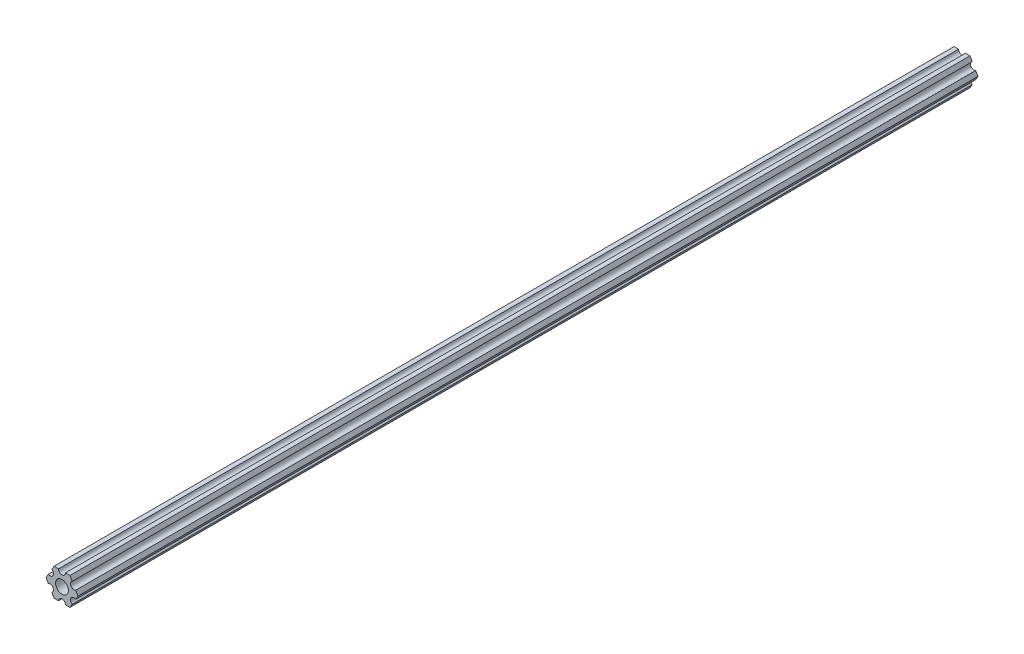
ISO-10303-21;
HEADER;
FILE_DESCRIPTION(('STEP AP214'),'2;1');
FILE_NAME('part.step','',(''),(''),'','','');
FILE_SCHEMA(('AUTOMOTIVE_DESIGN { 1 0 10303 214 1 1 1 1 }'));
ENDSEC;
DATA;
#1=APPLICATION_CONTEXT('core data for automotive mechanical design processes');
#2=APPLICATION_PROTOCOL_DEFINITION('international standard','automotive_design',2000,#1);
#3=PRODUCT_CONTEXT('',#1,'mechanical');
#4=PRODUCT('Part','Part','',(#3));
#5=PRODUCT_RELATED_PRODUCT_CATEGORY('part','',(#4));
#6=PRODUCT_DEFINITION_FORMATION('','',#4);
#7=PRODUCT_DEFINITION_CONTEXT('part definition',#1,'design');
#8=PRODUCT_DEFINITION('design','',#6,#7);
#9=PRODUCT_DEFINITION_SHAPE('','',#8);
#10=(LENGTH_UNIT() NAMED_UNIT(*) SI_UNIT(.MILLI.,.METRE.));
#11=(NAMED_UNIT(*) PLANE_ANGLE_UNIT() SI_UNIT($,.RADIAN.));
#12=(NAMED_UNIT(*) SI_UNIT($,.STERADIAN.) SOLID_ANGLE_UNIT());
#13=UNCERTAINTY_MEASURE_WITH_UNIT(LENGTH_MEASURE(1.E-05),#10,'distance_accuracy_value','');
#14=(GEOMETRIC_REPRESENTATION_CONTEXT(3) GLOBAL_UNCERTAINTY_ASSIGNED_CONTEXT((#13)) GLOBAL_UNIT_ASSIGNED_CONTEXT((#10,
#11,#12)) REPRESENTATION_CONTEXT('',''));
#15=CARTESIAN_POINT('',(0.,0.,0.));
#16=DIRECTION('',(0.,0.,1.));
#17=DIRECTION('',(1.,0.,0.));
#18=AXIS2_PLACEMENT_3D('',#15,#16,#17);
#19=CARTESIAN_POINT('',(6.29301142309098,-1.80018429024546,412.75));
#20=DIRECTION('',(-0.866025434075728,0.499999947533944,0.));
#21=DIRECTION('',(-0.499999947533944,-0.866025434075728,0.));
#22=AXIS2_PLACEMENT_3D('',#19,#20,#21);
#23=PLANE('',#22);
#24=DIRECTION('',(0.,0.,1.));
#25=VECTOR('',#24,1.);
#26=CARTESIAN_POINT('',(7.33234841870825,4.44212536187977E-07,412.75));
#27=LINE('',#26,#25);
#28=CARTESIAN_POINT('',(7.33234841870825,4.4421253590961E-07,0.));
#29=VERTEX_POINT('',#28);
#30=CARTESIAN_POINT('',(7.33234841870825,4.4421253664489E-07,412.75));
#31=VERTEX_POINT('',#30);
#32=EDGE_CURVE('E321',#29,#31,#27,.T.);
#33=ORIENTED_EDGE('',*,*,#32,.T.);
#34=DIRECTION('',(0.499999947533944,0.866025434075728,0.));
#35=VECTOR('',#34,1.);
#36=CARTESIAN_POINT('',(6.29301142309098,-1.80018429024546,412.75));
#37=LINE('',#36,#35);
#38=CARTESIAN_POINT('',(6.29301142309098,-1.80018429024546,412.75));
#39=VERTEX_POINT('',#38);
#40=EDGE_CURVE('E213',#39,#31,#37,.T.);
#41=ORIENTED_EDGE('',*,*,#40,.F.);
#42=DIRECTION('',(0.,0.,-1.));
#43=VECTOR('',#42,1.);
#44=CARTESIAN_POINT('',(6.29301142309098,-1.80018429024546,412.75));
#45=LINE('',#44,#43);
#46=CARTESIAN_POINT('',(6.29301142309098,-1.80018429024546,0.));
#47=VERTEX_POINT('',#46);
#48=EDGE_CURVE('E266',#39,#47,#45,.T.);
#49=ORIENTED_EDGE('',*,*,#48,.T.);
#50=DIRECTION('',(0.499999947533944,0.866025434075728,0.));
#51=VECTOR('',#50,1.);
#52=CARTESIAN_POINT('',(6.29301142309098,-1.80018429024546,0.));
#53=LINE('',#52,#51);
#54=EDGE_CURVE('E216',#47,#29,#53,.T.);
#55=ORIENTED_EDGE('',*,*,#54,.T.);
#56=EDGE_LOOP('',(#33,#41,#49,#55));
#57=FACE_BOUND('',#56,.T.);
#58=ADVANCED_FACE('F16',(#57),#23,.F.);
#59=CARTESIAN_POINT('',(7.33234841870825,4.44212536187977E-07,412.75));
#60=DIRECTION('',(-0.866025373493146,-0.500000052466055,0.));
#61=DIRECTION('',(0.500000052466055,-0.866025373493146,0.));
#62=AXIS2_PLACEMENT_3D('',#59,#60,#61);
#63=PLANE('',#62);
#64=DIRECTION('',(0.,0.,-1.));
#65=VECTOR('',#64,1.);
#66=CARTESIAN_POINT('',(6.29301120497139,1.80018505273895,412.75));
#67=LINE('',#66,#65);
#68=CARTESIAN_POINT('',(6.29301120497139,1.80018505273895,0.));
#69=VERTEX_POINT('',#68);
#70=CARTESIAN_POINT('',(6.29301120497139,1.80018505273895,412.75));
#71=VERTEX_POINT('',#70);
#72=EDGE_CURVE('E318',#69,#71,#67,.F.);
#73=ORIENTED_EDGE('',*,*,#72,.T.);
#74=DIRECTION('',(-0.500000052466055,0.866025373493145,0.));
#75=VECTOR('',#74,1.);
#76=CARTESIAN_POINT('',(7.33234841870825,4.44212536112459E-07,412.75));
#77=LINE('',#76,#75);
#78=EDGE_CURVE('E76',#31,#71,#77,.T.);
#79=ORIENTED_EDGE('',*,*,#78,.F.);
#80=ORIENTED_EDGE('',*,*,#32,.F.);
#81=DIRECTION('',(-0.500000052466055,0.866025373493145,0.));
#82=VECTOR('',#81,1.);
#83=CARTESIAN_POINT('',(7.33234841870825,4.44212536112459E-07,0.));
#84=LINE('',#83,#82);
#85=EDGE_CURVE('E262',#29,#69,#84,.T.);
#86=ORIENTED_EDGE('',*,*,#85,.T.);
#87=EDGE_LOOP('',(#73,#79,#80,#86));
#88=FACE_BOUND('',#87,.T.);
#89=ADVANCED_FACE('F380',(#88),#63,.F.);
#90=CARTESIAN_POINT('',(5.49926112168156,3.17500033315933,412.75));
#91=DIRECTION('',(0.,0.,-1.));
#92=DIRECTION('',(-1.,0.,0.));
#93=AXIS2_PLACEMENT_3D('',#90,#91,#92);
#94=CYLINDRICAL_SURFACE('',#93,1.5875);
#95=CARTESIAN_POINT('',(5.49926112168156,3.17500033315933,412.75));
#96=DIRECTION('',(0.,0.,-1.));
#97=DIRECTION('',(-1.,0.,0.));
#98=AXIS2_PLACEMENT_3D('',#95,#96,#97);
#99=CIRCLE('',#98,1.5875);
#100=CARTESIAN_POINT('',(4.70551103839172,4.54981561357972,412.75));
#101=VERTEX_POINT('',#100);
#102=EDGE_CURVE('E65',#71,#101,#99,.T.);
#103=ORIENTED_EDGE('',*,*,#102,.F.);
#104=ORIENTED_EDGE('',*,*,#72,.F.);
#105=CARTESIAN_POINT('',(5.49926112168156,3.17500033315933,0.));
#106=DIRECTION('',(0.,0.,-1.));
#107=DIRECTION('',(-1.,0.,0.));
#108=AXIS2_PLACEMENT_3D('',#105,#106,#107);
#109=CIRCLE('',#108,1.5875);
#110=CARTESIAN_POINT('',(4.70551103839172,4.54981561357972,0.));
#111=VERTEX_POINT('',#110);
#112=EDGE_CURVE('E19',#69,#111,#109,.T.);
#113=ORIENTED_EDGE('',*,*,#112,.T.);
#114=DIRECTION('',(0.,0.,1.));
#115=VECTOR('',#114,1.);
#116=CARTESIAN_POINT('',(4.70551103839172,4.54981561357972,412.75));
#117=LINE('',#116,#115);
#118=EDGE_CURVE('E315',#111,#101,#117,.T.);
#119=ORIENTED_EDGE('',*,*,#118,.T.);
#120=EDGE_LOOP('',(#103,#104,#113,#119));
#121=FACE_BOUND('',#120,.T.);
#122=ADVANCED_FACE('F378',(#121),#94,.F.);
#123=CARTESIAN_POINT('',(4.70551103839172,4.54981561357972,412.75));
#124=DIRECTION('',(-0.866025373493151,-0.500000052466046,0.));
#125=DIRECTION('',(0.500000052466046,-0.866025373493151,0.));
#126=AXIS2_PLACEMENT_3D('',#123,#124,#125);
#127=PLANE('',#126);
#128=DIRECTION('',(0.,0.,1.));
#129=VECTOR('',#128,1.);
#130=CARTESIAN_POINT('',(3.66617382465481,6.35000022210627,412.75));
#131=LINE('',#130,#129);
#132=CARTESIAN_POINT('',(3.66617382465481,6.35000022210627,-1.29526019539602E-13));
#133=VERTEX_POINT('',#132);
#134=CARTESIAN_POINT('',(3.66617382465481,6.35000022210627,412.75));
#135=VERTEX_POINT('',#134);
#136=EDGE_CURVE('E311',#133,#135,#131,.T.);
#137=ORIENTED_EDGE('',*,*,#136,.T.);
#138=DIRECTION('',(-0.500000052466046,0.866025373493151,0.));
#139=VECTOR('',#138,1.);
#140=CARTESIAN_POINT('',(4.70551103839172,4.54981561357972,412.75));
#141=LINE('',#140,#139);
#142=EDGE_CURVE('E208',#101,#135,#141,.T.);
#143=ORIENTED_EDGE('',*,*,#142,.F.);
#144=ORIENTED_EDGE('',*,*,#118,.F.);
#145=DIRECTION('',(-0.500000052466046,0.866025373493151,0.));
#146=VECTOR('',#145,1.);
#147=CARTESIAN_POINT('',(4.70551103839172,4.54981561357972,0.));
#148=LINE('',#147,#146);
#149=EDGE_CURVE('E258',#111,#133,#148,.T.);
#150=ORIENTED_EDGE('',*,*,#149,.T.);
#151=EDGE_LOOP('',(#137,#143,#144,#150));
#152=FACE_BOUND('',#151,.T.);
#153=ADVANCED_FACE('F369',(#152),#127,.F.);
#154=CARTESIAN_POINT('',(3.66617382465481,6.35000022210627,412.75));
#155=DIRECTION('',(6.05825850611185E-08,-0.999999999999998,0.));
#156=DIRECTION('',(0.999999999999998,6.05825850611185E-08,0.));
#157=AXIS2_PLACEMENT_3D('',#154,#155,#156);
#158=PLANE('',#157);
#159=DIRECTION('',(0.,0.,-1.));
#160=VECTOR('',#159,1.);
#161=CARTESIAN_POINT('',(1.58749961530074,6.35000009617482,412.75));
#162=LINE('',#161,#160);
#163=CARTESIAN_POINT('',(1.58749961530073,6.35000015914054,0.));
#164=VERTEX_POINT('',#163);
#165=CARTESIAN_POINT('',(1.58749961530073,6.35000015914054,412.75));
#166=VERTEX_POINT('',#165);
#167=EDGE_CURVE('E308',#164,#166,#162,.F.);
#168=ORIENTED_EDGE('',*,*,#167,.T.);
#169=DIRECTION('',(1.,0.,0.));
#170=VECTOR('',#169,1.);
#171=CARTESIAN_POINT('',(5.49926112168156,6.35000022210627,412.75));
#172=LINE('',#171,#170);
#173=EDGE_CURVE('E175',#135,#166,#172,.F.);
#174=ORIENTED_EDGE('',*,*,#173,.F.);
#175=ORIENTED_EDGE('',*,*,#136,.F.);
#176=DIRECTION('',(1.,0.,0.));
#177=VECTOR('',#176,1.);
#178=CARTESIAN_POINT('',(5.49926112168156,6.35000022210627,0.));
#179=LINE('',#178,#177);
#180=EDGE_CURVE('E254',#133,#164,#179,.F.);
#181=ORIENTED_EDGE('',*,*,#180,.T.);
#182=EDGE_LOOP('',(#168,#174,#175,#181));
#183=FACE_BOUND('',#182,.T.);
#184=ADVANCED_FACE('F366',(#183),#158,.F.);
#185=CARTESIAN_POINT('',(-3.84699260060323E-07,6.35,412.75));
#186=DIRECTION('',(0.,0.,-1.));
#187=DIRECTION('',(-1.,0.,0.));
#188=AXIS2_PLACEMENT_3D('',#185,#186,#187);
#189=CYLINDRICAL_SURFACE('',#188,1.5875);
#190=DIRECTION('',(0.,0.,1.));
#191=VECTOR('',#190,1.);
#192=CARTESIAN_POINT('',(-1.58750038469926,6.34999990382518,412.75));
#193=LINE('',#192,#191);
#194=CARTESIAN_POINT('',(-1.58750038469926,6.34999990382518,0.));
#195=VERTEX_POINT('',#194);
#196=CARTESIAN_POINT('',(-1.58750038469926,6.34999990382518,412.75));
#197=VERTEX_POINT('',#196);
#198=EDGE_CURVE('E126',#195,#197,#193,.T.);
#199=ORIENTED_EDGE('',*,*,#198,.T.);
#200=CARTESIAN_POINT('',(-3.84699260060323E-07,6.35,412.75));
#201=DIRECTION('',(0.,0.,-1.));
#202=DIRECTION('',(-1.,0.,0.));
#203=AXIS2_PLACEMENT_3D('',#200,#201,#202);
#204=CIRCLE('',#203,1.5875);
#205=EDGE_CURVE('E181',#166,#197,#204,.T.);
#206=ORIENTED_EDGE('',*,*,#205,.F.);
#207=ORIENTED_EDGE('',*,*,#167,.F.);
#208=CARTESIAN_POINT('',(-3.84699260060323E-07,6.35,0.));
#209=DIRECTION('',(0.,0.,-1.));
#210=DIRECTION('',(-1.,0.,0.));
#211=AXIS2_PLACEMENT_3D('',#208,#209,#210);
#212=CIRCLE('',#211,1.5875);
#213=EDGE_CURVE('E253',#164,#195,#212,.T.);
#214=ORIENTED_EDGE('',*,*,#213,.T.);
#215=EDGE_LOOP('',(#199,#206,#207,#214));
#216=FACE_BOUND('',#215,.T.);
#217=ADVANCED_FACE('F360',(#216),#189,.F.);
#218=CARTESIAN_POINT('',(-1.58750038469926,6.34999990382518,412.75));
#219=DIRECTION('',(6.05825963273174E-08,-0.999999999999998,0.));
#220=DIRECTION('',(0.999999999999998,6.05825963273174E-08,0.));
#221=AXIS2_PLACEMENT_3D('',#218,#219,#220);
#222=PLANE('',#221);
#223=DIRECTION('',(0.,0.,1.));
#224=VECTOR('',#223,1.);
#225=CARTESIAN_POINT('',(-3.66617459405349,6.3499997778937,412.75));
#226=LINE('',#225,#224);
#227=CARTESIAN_POINT('',(-3.66617454558244,6.34999986184803,-1.29526019539602E-13));
#228=VERTEX_POINT('',#227);
#229=CARTESIAN_POINT('',(-3.66617454558244,6.34999986184803,412.75));
#230=VERTEX_POINT('',#229);
#231=EDGE_CURVE('E136',#228,#230,#226,.T.);
#232=ORIENTED_EDGE('',*,*,#231,.T.);
#233=DIRECTION('',(1.,0.,0.));
#234=VECTOR('',#233,1.);
#235=CARTESIAN_POINT('',(5.49926112168156,6.34999990382518,412.75));
#236=LINE('',#235,#234);
#237=EDGE_CURVE('E182',#197,#230,#236,.F.);
#238=ORIENTED_EDGE('',*,*,#237,.F.);
#239=ORIENTED_EDGE('',*,*,#198,.F.);
#240=DIRECTION('',(1.,0.,0.));
#241=VECTOR('',#240,1.);
#242=CARTESIAN_POINT('',(5.49926112168156,6.34999990382518,0.));
#243=LINE('',#242,#241);
#244=EDGE_CURVE('E190',#195,#228,#243,.F.);
#245=ORIENTED_EDGE('',*,*,#244,.T.);
#246=EDGE_LOOP('',(#232,#238,#239,#245));
#247=FACE_BOUND('',#246,.T.);
#248=ADVANCED_FACE('F189',(#247),#222,.F.);
#249=CARTESIAN_POINT('',(-3.66617459405349,6.3499997778937,412.75));
#250=DIRECTION('',(0.866025434075729,-0.499999947533942,0.));
#251=DIRECTION('',(0.499999947533942,0.866025434075729,0.));
#252=AXIS2_PLACEMENT_3D('',#249,#250,#251);
#253=PLANE('',#252);
#254=DIRECTION('',(0.,0.,-1.));
#255=VECTOR('',#254,1.);
#256=CARTESIAN_POINT('',(-4.70551158967065,4.54981504343587,412.75));
#257=LINE('',#256,#255);
#258=CARTESIAN_POINT('',(-4.70551158967065,4.54981504343587,0.));
#259=VERTEX_POINT('',#258);
#260=CARTESIAN_POINT('',(-4.70551158967065,4.54981504343587,412.75));
#261=VERTEX_POINT('',#260);
#262=EDGE_CURVE('E192',#259,#261,#257,.F.);
#263=ORIENTED_EDGE('',*,*,#262,.T.);
#264=DIRECTION('',(-0.499999947533943,-0.866025434075729,0.));
#265=VECTOR('',#264,1.);
#266=CARTESIAN_POINT('',(-3.66617459405349,6.3499997778937,412.75));
#267=LINE('',#266,#265);
#268=EDGE_CURVE('E185',#230,#261,#267,.T.);
#269=ORIENTED_EDGE('',*,*,#268,.F.);
#270=ORIENTED_EDGE('',*,*,#231,.F.);
#271=DIRECTION('',(-0.499999947533943,-0.866025434075729,0.));
#272=VECTOR('',#271,1.);
#273=CARTESIAN_POINT('',(-3.66617459405349,6.3499997778937,0.));
#274=LINE('',#273,#272);
#275=EDGE_CURVE('E248',#228,#259,#274,.T.);
#276=ORIENTED_EDGE('',*,*,#275,.T.);
#277=EDGE_LOOP('',(#263,#269,#270,#276));
#278=FACE_BOUND('',#277,.T.);
#279=ADVANCED_FACE('F194',(#278),#253,.F.);
#280=CARTESIAN_POINT('',(-5.49926150638082,3.17499966684067,412.75));
#281=DIRECTION('',(0.,0.,-1.));
#282=DIRECTION('',(-1.,0.,0.));
#283=AXIS2_PLACEMENT_3D('',#280,#281,#282);
#284=CYLINDRICAL_SURFACE('',#283,1.5875);
#285=DIRECTION('',(0.,0.,1.));
#286=VECTOR('',#285,1.);
#287=CARTESIAN_POINT('',(-6.29301142309098,1.80018429024547,412.75));
#288=LINE('',#287,#286);
#289=CARTESIAN_POINT('',(-6.29301142309098,1.80018429024547,0.));
#290=VERTEX_POINT('',#289);
#291=CARTESIAN_POINT('',(-6.29301142309098,1.80018429024547,412.75));
#292=VERTEX_POINT('',#291);
#293=EDGE_CURVE('E300',#290,#292,#288,.T.);
#294=ORIENTED_EDGE('',*,*,#293,.T.);
#295=CARTESIAN_POINT('',(-5.49926150638082,3.17499966684067,412.75));
#296=DIRECTION('',(0.,0.,-1.));
#297=DIRECTION('',(-1.,0.,0.));
#298=AXIS2_PLACEMENT_3D('',#295,#296,#297);
#299=CIRCLE('',#298,1.5875);
#300=EDGE_CURVE('E197',#261,#292,#299,.T.);
#301=ORIENTED_EDGE('',*,*,#300,.F.);
#302=ORIENTED_EDGE('',*,*,#262,.F.);
#303=CARTESIAN_POINT('',(-5.49926150638082,3.17499966684067,0.));
#304=DIRECTION('',(0.,0.,-1.));
#305=DIRECTION('',(-1.,0.,0.));
#306=AXIS2_PLACEMENT_3D('',#303,#304,#305);
#307=CIRCLE('',#306,1.5875);
#308=EDGE_CURVE('E247',#259,#290,#307,.T.);
#309=ORIENTED_EDGE('',*,*,#308,.T.);
#310=EDGE_LOOP('',(#294,#301,#302,#309));
#311=FACE_BOUND('',#310,.T.);
#312=ADVANCED_FACE('F443',(#311),#284,.F.);
#313=CARTESIAN_POINT('',(-6.29301142309098,1.80018429024547,412.75));
#314=DIRECTION('',(0.866025434075724,-0.499999947533951,0.));
#315=DIRECTION('',(0.499999947533951,0.866025434075724,0.));
#316=AXIS2_PLACEMENT_3D('',#313,#314,#315);
#317=PLANE('',#316);
#318=DIRECTION('',(0.,0.,1.));
#319=VECTOR('',#318,1.);
#320=CARTESIAN_POINT('',(-7.33234841870826,-4.44212523790841E-07,412.75));
#321=LINE('',#320,#319);
#322=CARTESIAN_POINT('',(-7.33234841870826,-4.44212524036367E-07,0.));
#323=VERTEX_POINT('',#322);
#324=CARTESIAN_POINT('',(-7.33234841870826,-4.44212524036367E-07,412.75));
#325=VERTEX_POINT('',#324);
#326=EDGE_CURVE('E296',#323,#325,#321,.T.);
#327=ORIENTED_EDGE('',*,*,#326,.T.);
#328=DIRECTION('',(-0.499999947533952,-0.866025434075724,0.));
#329=VECTOR('',#328,1.);
#330=CARTESIAN_POINT('',(-6.29301142309098,1.80018429024547,412.75));
#331=LINE('',#330,#329);
#332=EDGE_CURVE('E202',#292,#325,#331,.T.);
#333=ORIENTED_EDGE('',*,*,#332,.F.);
#334=ORIENTED_EDGE('',*,*,#293,.F.);
#335=DIRECTION('',(-0.499999947533952,-0.866025434075724,0.));
#336=VECTOR('',#335,1.);
#337=CARTESIAN_POINT('',(-6.29301142309098,1.80018429024547,0.));
#338=LINE('',#337,#336);
#339=EDGE_CURVE('E243',#290,#323,#338,.T.);
#340=ORIENTED_EDGE('',*,*,#339,.T.);
#341=EDGE_LOOP('',(#327,#333,#334,#340));
#342=FACE_BOUND('',#341,.T.);
#343=ADVANCED_FACE('F406',(#342),#317,.F.);
#344=CARTESIAN_POINT('',(-7.33234841870826,-4.44212523790841E-07,412.75));
#345=DIRECTION('',(0.866025373493151,0.500000052466045,0.));
#346=DIRECTION('',(-0.500000052466045,0.866025373493151,0.));
#347=AXIS2_PLACEMENT_3D('',#344,#345,#346);
#348=PLANE('',#347);
#349=DIRECTION('',(0.,0.,-1.));
#350=VECTOR('',#349,1.);
#351=CARTESIAN_POINT('',(-6.29301120497141,-1.80018505273896,412.75));
#352=LINE('',#351,#350);
#353=CARTESIAN_POINT('',(-6.29301120497141,-1.80018505273896,0.));
#354=VERTEX_POINT('',#353);
#355=CARTESIAN_POINT('',(-6.29301120497141,-1.80018505273896,412.75));
#356=VERTEX_POINT('',#355);
#357=EDGE_CURVE('E292',#354,#356,#352,.F.);
#358=ORIENTED_EDGE('',*,*,#357,.T.);
#359=DIRECTION('',(0.500000052466045,-0.866025373493151,0.));
#360=VECTOR('',#359,1.);
#361=CARTESIAN_POINT('',(-7.33234841870826,-4.44212523969395E-07,412.75));
#362=LINE('',#361,#360);
#363=EDGE_CURVE('E339',#325,#356,#362,.T.);
#364=ORIENTED_EDGE('',*,*,#363,.F.);
#365=ORIENTED_EDGE('',*,*,#326,.F.);
#366=DIRECTION('',(0.500000052466045,-0.866025373493151,0.));
#367=VECTOR('',#366,1.);
#368=CARTESIAN_POINT('',(-7.33234841870826,-4.44212523969395E-07,0.));
#369=LINE('',#368,#367);
#370=EDGE_CURVE('E239',#323,#354,#369,.T.);
#371=ORIENTED_EDGE('',*,*,#370,.T.);
#372=EDGE_LOOP('',(#358,#364,#365,#371));
#373=FACE_BOUND('',#372,.T.);
#374=ADVANCED_FACE('F410',(#373),#348,.F.);
#375=CARTESIAN_POINT('',(-5.49926112168156,-3.17500033315934,412.75));
#376=DIRECTION('',(0.,0.,-1.));
#377=DIRECTION('',(-1.,0.,0.));
#378=AXIS2_PLACEMENT_3D('',#375,#376,#377);
#379=CYLINDRICAL_SURFACE('',#378,1.5875);
#380=DIRECTION('',(0.,0.,1.));
#381=VECTOR('',#380,1.);
#382=CARTESIAN_POINT('',(-4.70551103839172,-4.54981561357972,412.75));
#383=LINE('',#382,#381);
#384=CARTESIAN_POINT('',(-4.70551103839172,-4.54981561357972,0.));
#385=VERTEX_POINT('',#384);
#386=CARTESIAN_POINT('',(-4.70551103839172,-4.54981561357972,412.75));
#387=VERTEX_POINT('',#386);
#388=EDGE_CURVE('E288',#385,#387,#383,.T.);
#389=ORIENTED_EDGE('',*,*,#388,.T.);
#390=CARTESIAN_POINT('',(-5.49926112168156,-3.17500033315934,412.75));
#391=DIRECTION('',(0.,0.,-1.));
#392=DIRECTION('',(-1.,0.,0.));
#393=AXIS2_PLACEMENT_3D('',#390,#391,#392);
#394=CIRCLE('',#393,1.5875);
#395=EDGE_CURVE('E336',#356,#387,#394,.T.);
#396=ORIENTED_EDGE('',*,*,#395,.F.);
#397=ORIENTED_EDGE('',*,*,#357,.F.);
#398=CARTESIAN_POINT('',(-5.49926112168156,-3.17500033315934,0.));
#399=DIRECTION('',(0.,0.,-1.));
#400=DIRECTION('',(-1.,0.,0.));
#401=AXIS2_PLACEMENT_3D('',#398,#399,#400);
#402=CIRCLE('',#401,1.5875);
#403=EDGE_CURVE('E238',#354,#385,#402,.T.);
#404=ORIENTED_EDGE('',*,*,#403,.T.);
#405=EDGE_LOOP('',(#389,#396,#397,#404));
#406=FACE_BOUND('',#405,.T.);
#407=ADVANCED_FACE('F414',(#406),#379,.F.);
#408=CARTESIAN_POINT('',(-4.70551103839172,-4.54981561357972,412.75));
#409=DIRECTION('',(0.866025373493151,0.500000052466045,0.));
#410=DIRECTION('',(-0.500000052466045,0.866025373493151,0.));
#411=AXIS2_PLACEMENT_3D('',#408,#409,#410);
#412=PLANE('',#411);
#413=DIRECTION('',(0.,0.,1.));
#414=VECTOR('',#413,1.);
#415=CARTESIAN_POINT('',(-3.66617382465481,-6.35000022210628,412.75));
#416=LINE('',#415,#414);
#417=CARTESIAN_POINT('',(-3.6661738246548,-6.35000022210628,-1.29526019539602E-13));
#418=VERTEX_POINT('',#417);
#419=CARTESIAN_POINT('',(-3.6661738246548,-6.35000022210628,412.75));
#420=VERTEX_POINT('',#419);
#421=EDGE_CURVE('E284',#418,#420,#416,.T.);
#422=ORIENTED_EDGE('',*,*,#421,.T.);
#423=DIRECTION('',(0.500000052466045,-0.866025373493151,0.));
#424=VECTOR('',#423,1.);
#425=CARTESIAN_POINT('',(-4.70551103839172,-4.54981561357972,412.75));
#426=LINE('',#425,#424);
#427=EDGE_CURVE('E338',#387,#420,#426,.T.);
#428=ORIENTED_EDGE('',*,*,#427,.F.);
#429=ORIENTED_EDGE('',*,*,#388,.F.);
#430=DIRECTION('',(0.500000052466045,-0.866025373493151,0.));
#431=VECTOR('',#430,1.);
#432=CARTESIAN_POINT('',(-4.70551103839172,-4.54981561357972,0.));
#433=LINE('',#432,#431);
#434=EDGE_CURVE('E234',#385,#418,#433,.T.);
#435=ORIENTED_EDGE('',*,*,#434,.T.);
#436=EDGE_LOOP('',(#422,#428,#429,#435));
#437=FACE_BOUND('',#436,.T.);
#438=ADVANCED_FACE('F421',(#437),#412,.F.);
#439=CARTESIAN_POINT('',(-3.66617382465481,-6.35000022210628,412.75));
#440=DIRECTION('',(-6.05825854783851E-08,0.999999999999998,0.));
#441=DIRECTION('',(-0.999999999999998,-6.05825854783851E-08,0.));
#442=AXIS2_PLACEMENT_3D('',#439,#440,#441);
#443=PLANE('',#442);
#444=DIRECTION('',(0.,0.,-1.));
#445=VECTOR('',#444,1.);
#446=CARTESIAN_POINT('',(-1.58749961530074,-6.35,412.75));
#447=LINE('',#446,#445);
#448=CARTESIAN_POINT('',(-1.58749961530073,-6.35000011105314,0.));
#449=VERTEX_POINT('',#448);
#450=CARTESIAN_POINT('',(-1.58749961530073,-6.35000011105314,412.75));
#451=VERTEX_POINT('',#450);
#452=EDGE_CURVE('E280',#449,#451,#447,.F.);
#453=ORIENTED_EDGE('',*,*,#452,.T.);
#454=DIRECTION('',(1.,0.,0.));
#455=VECTOR('',#454,1.);
#456=CARTESIAN_POINT('',(5.49926112168156,-6.35000022210628,412.75));
#457=LINE('',#456,#455);
#458=EDGE_CURVE('E335',#420,#451,#457,.T.);
#459=ORIENTED_EDGE('',*,*,#458,.F.);
#460=ORIENTED_EDGE('',*,*,#421,.F.);
#461=DIRECTION('',(1.,0.,0.));
#462=VECTOR('',#461,1.);
#463=CARTESIAN_POINT('',(5.49926112168156,-6.35000022210628,0.));
#464=LINE('',#463,#462);
#465=EDGE_CURVE('E230',#418,#449,#464,.T.);
#466=ORIENTED_EDGE('',*,*,#465,.T.);
#467=EDGE_LOOP('',(#453,#459,#460,#466));
#468=FACE_BOUND('',#467,.T.);
#469=ADVANCED_FACE('F425',(#468),#443,.F.);
#470=CARTESIAN_POINT('',(3.8469926204343E-07,-6.35,412.75));
#471=DIRECTION('',(0.,0.,-1.));
#472=DIRECTION('',(-1.,0.,0.));
#473=AXIS2_PLACEMENT_3D('',#470,#471,#472);
#474=CYLINDRICAL_SURFACE('',#473,1.5875);
#475=DIRECTION('',(0.,0.,1.));
#476=VECTOR('',#475,1.);
#477=CARTESIAN_POINT('',(1.58750038469926,-6.34999990382518,412.75));
#478=LINE('',#477,#476);
#479=CARTESIAN_POINT('',(1.58750038469926,-6.34999990382518,0.));
#480=VERTEX_POINT('',#479);
#481=CARTESIAN_POINT('',(1.58750038469926,-6.34999990382518,412.75));
#482=VERTEX_POINT('',#481);
#483=EDGE_CURVE('E276',#480,#482,#478,.T.);
#484=ORIENTED_EDGE('',*,*,#483,.T.);
#485=CARTESIAN_POINT('',(3.8469926204343E-07,-6.35,412.75));
#486=DIRECTION('',(0.,0.,-1.));
#487=DIRECTION('',(-1.,0.,0.));
#488=AXIS2_PLACEMENT_3D('',#485,#486,#487);
#489=CIRCLE('',#488,1.5875);
#490=EDGE_CURVE('E331',#451,#482,#489,.T.);
#491=ORIENTED_EDGE('',*,*,#490,.F.);
#492=ORIENTED_EDGE('',*,*,#452,.F.);
#493=CARTESIAN_POINT('',(3.8469926204343E-07,-6.35,0.));
#494=DIRECTION('',(0.,0.,-1.));
#495=DIRECTION('',(-1.,0.,0.));
#496=AXIS2_PLACEMENT_3D('',#493,#494,#495);
#497=CIRCLE('',#496,1.5875);
#498=EDGE_CURVE('E229',#449,#480,#497,.T.);
#499=ORIENTED_EDGE('',*,*,#498,.T.);
#500=EDGE_LOOP('',(#484,#491,#492,#499));
#501=FACE_BOUND('',#500,.T.);
#502=ADVANCED_FACE('F429',(#501),#474,.F.);
#503=CARTESIAN_POINT('',(1.58750038469926,-6.34999990382518,412.75));
#504=DIRECTION('',(-6.05825721258438E-08,0.999999999999998,0.));
#505=DIRECTION('',(-0.999999999999998,-6.05825721258438E-08,0.));
#506=AXIS2_PLACEMENT_3D('',#503,#504,#505);
#507=PLANE('',#506);
#508=DIRECTION('',(0.,0.,1.));
#509=VECTOR('',#508,1.);
#510=CARTESIAN_POINT('',(3.66617459405346,-6.34999977789375,412.75));
#511=LINE('',#510,#509);
#512=CARTESIAN_POINT('',(3.66617454558244,-6.34999986184804,-1.29526019539602E-13));
#513=VERTEX_POINT('',#512);
#514=CARTESIAN_POINT('',(3.66617454558244,-6.34999986184804,412.75));
#515=VERTEX_POINT('',#514);
#516=EDGE_CURVE('E272',#513,#515,#511,.T.);
#517=ORIENTED_EDGE('',*,*,#516,.T.);
#518=DIRECTION('',(1.,0.,0.));
#519=VECTOR('',#518,1.);
#520=CARTESIAN_POINT('',(5.49926112168156,-6.34999990382518,412.75));
#521=LINE('',#520,#519);
#522=EDGE_CURVE('E334',#482,#515,#521,.T.);
#523=ORIENTED_EDGE('',*,*,#522,.F.);
#524=ORIENTED_EDGE('',*,*,#483,.F.);
#525=DIRECTION('',(1.,0.,0.));
#526=VECTOR('',#525,1.);
#527=CARTESIAN_POINT('',(5.49926112168156,-6.34999990382518,0.));
#528=LINE('',#527,#526);
#529=EDGE_CURVE('E225',#480,#513,#528,.T.);
#530=ORIENTED_EDGE('',*,*,#529,.T.);
#531=EDGE_LOOP('',(#517,#523,#524,#530));
#532=FACE_BOUND('',#531,.T.);
#533=ADVANCED_FACE('F432',(#532),#507,.F.);
#534=CARTESIAN_POINT('',(3.66617459405346,-6.34999977789375,412.75));
#535=DIRECTION('',(-0.86602543407573,0.499999947533941,0.));
#536=DIRECTION('',(-0.499999947533941,-0.86602543407573,0.));
#537=AXIS2_PLACEMENT_3D('',#534,#535,#536);
#538=PLANE('',#537);
#539=DIRECTION('',(0.,0.,1.));
#540=VECTOR('',#539,1.);
#541=CARTESIAN_POINT('',(4.70551158967065,-4.54981504343587,412.75));
#542=LINE('',#541,#540);
#543=CARTESIAN_POINT('',(4.70551158967065,-4.54981504343587,412.75));
#544=VERTEX_POINT('',#543);
#545=CARTESIAN_POINT('',(4.70551158967065,-4.54981504343587,0.));
#546=VERTEX_POINT('',#545);
#547=EDGE_CURVE('E269',#544,#546,#542,.F.);
#548=ORIENTED_EDGE('',*,*,#547,.F.);
#549=DIRECTION('',(0.49999994753394,0.86602543407573,0.));
#550=VECTOR('',#549,1.);
#551=CARTESIAN_POINT('',(3.66617459405346,-6.34999977789376,412.75));
#552=LINE('',#551,#550);
#553=EDGE_CURVE('E330',#515,#544,#552,.T.);
#554=ORIENTED_EDGE('',*,*,#553,.F.);
#555=ORIENTED_EDGE('',*,*,#516,.F.);
#556=DIRECTION('',(0.49999994753394,0.86602543407573,0.));
#557=VECTOR('',#556,1.);
#558=CARTESIAN_POINT('',(3.66617459405346,-6.34999977789376,0.));
#559=LINE('',#558,#557);
#560=EDGE_CURVE('E221',#513,#546,#559,.T.);
#561=ORIENTED_EDGE('',*,*,#560,.T.);
#562=EDGE_LOOP('',(#548,#554,#555,#561));
#563=FACE_BOUND('',#562,.T.);
#564=ADVANCED_FACE('F434',(#563),#538,.F.);
#565=CARTESIAN_POINT('',(5.49926150638082,-3.17499966684067,412.75));
#566=DIRECTION('',(0.,0.,-1.));
#567=DIRECTION('',(-1.,0.,0.));
#568=AXIS2_PLACEMENT_3D('',#565,#566,#567);
#569=CYLINDRICAL_SURFACE('',#568,1.58750000000001);
#570=CARTESIAN_POINT('',(5.49926150638082,-3.17499966684067,412.75));
#571=DIRECTION('',(0.,0.,-1.));
#572=DIRECTION('',(-1.,0.,0.));
#573=AXIS2_PLACEMENT_3D('',#570,#571,#572);
#574=CIRCLE('',#573,1.58750000000001);
#575=EDGE_CURVE('E39',#544,#39,#574,.T.);
#576=ORIENTED_EDGE('',*,*,#575,.F.);
#577=ORIENTED_EDGE('',*,*,#547,.T.);
#578=CARTESIAN_POINT('',(5.49926150638082,-3.17499966684067,0.));
#579=DIRECTION('',(0.,0.,-1.));
#580=DIRECTION('',(-1.,0.,0.));
#581=AXIS2_PLACEMENT_3D('',#578,#579,#580);
#582=CIRCLE('',#581,1.58750000000001);
#583=EDGE_CURVE('E220',#546,#47,#582,.T.);
#584=ORIENTED_EDGE('',*,*,#583,.T.);
#585=ORIENTED_EDGE('',*,*,#48,.F.);
#586=EDGE_LOOP('',(#576,#577,#584,#585));
#587=FACE_BOUND('',#586,.T.);
#588=ADVANCED_FACE('F384',(#587),#569,.F.);
#589=CARTESIAN_POINT('',(5.49926112168156,3.17500033315933,0.));
#590=DIRECTION('',(0.,0.,1.));
#591=DIRECTION('',(1.,0.,0.));
#592=AXIS2_PLACEMENT_3D('',#589,#590,#591);
#593=PLANE('',#592);
#594=CARTESIAN_POINT('',(0.,0.,0.));
#595=DIRECTION('',(0.,0.,-1.));
#596=DIRECTION('',(-1.,0.,0.));
#597=AXIS2_PLACEMENT_3D('',#594,#595,#596);
#598=CIRCLE('',#597,2.9337);
#599=CARTESIAN_POINT('',(-2.9337,0.,0.));
#600=VERTEX_POINT('',#599);
#601=EDGE_CURVE('E26',#600,#600,#598,.F.);
#602=ORIENTED_EDGE('',*,*,#601,.T.);
#603=EDGE_LOOP('',(#602));
#604=FACE_BOUND('',#603,.T.);
#605=ORIENTED_EDGE('',*,*,#583,.F.);
#606=ORIENTED_EDGE('',*,*,#560,.F.);
#607=ORIENTED_EDGE('',*,*,#529,.F.);
#608=ORIENTED_EDGE('',*,*,#498,.F.);
#609=ORIENTED_EDGE('',*,*,#465,.F.);
#610=ORIENTED_EDGE('',*,*,#434,.F.);
#611=ORIENTED_EDGE('',*,*,#403,.F.);
#612=ORIENTED_EDGE('',*,*,#370,.F.);
#613=ORIENTED_EDGE('',*,*,#339,.F.);
#614=ORIENTED_EDGE('',*,*,#308,.F.);
#615=ORIENTED_EDGE('',*,*,#275,.F.);
#616=ORIENTED_EDGE('',*,*,#244,.F.);
#617=ORIENTED_EDGE('',*,*,#213,.F.);
#618=ORIENTED_EDGE('',*,*,#180,.F.);
#619=ORIENTED_EDGE('',*,*,#149,.F.);
#620=ORIENTED_EDGE('',*,*,#112,.F.);
#621=ORIENTED_EDGE('',*,*,#85,.F.);
#622=ORIENTED_EDGE('',*,*,#54,.F.);
#623=EDGE_LOOP('',(#605,#606,#607,#608,#609,#610,#611,#612,#613,#614,#615,#616,#617,#618,#619,
#620,#621,#622));
#624=FACE_BOUND('',#623,.T.);
#625=ADVANCED_FACE('F363',(#604,#624),#593,.F.);
#626=CARTESIAN_POINT('',(5.49926112168156,3.17500033315933,412.75));
#627=DIRECTION('',(0.,0.,1.));
#628=DIRECTION('',(1.,0.,0.));
#629=AXIS2_PLACEMENT_3D('',#626,#627,#628);
#630=PLANE('',#629);
#631=CARTESIAN_POINT('',(0.,0.,412.75));
#632=DIRECTION('',(0.,0.,-1.));
#633=DIRECTION('',(-1.,0.,0.));
#634=AXIS2_PLACEMENT_3D('',#631,#632,#633);
#635=CIRCLE('',#634,2.9337);
#636=CARTESIAN_POINT('',(-2.9337,0.,412.75));
#637=VERTEX_POINT('',#636);
#638=EDGE_CURVE('E11',#637,#637,#635,.T.);
#639=ORIENTED_EDGE('',*,*,#638,.T.);
#640=EDGE_LOOP('',(#639));
#641=FACE_BOUND('',#640,.T.);
#642=ORIENTED_EDGE('',*,*,#553,.T.);
#643=ORIENTED_EDGE('',*,*,#575,.T.);
#644=ORIENTED_EDGE('',*,*,#40,.T.);
#645=ORIENTED_EDGE('',*,*,#78,.T.);
#646=ORIENTED_EDGE('',*,*,#102,.T.);
#647=ORIENTED_EDGE('',*,*,#142,.T.);
#648=ORIENTED_EDGE('',*,*,#173,.T.);
#649=ORIENTED_EDGE('',*,*,#205,.T.);
#650=ORIENTED_EDGE('',*,*,#237,.T.);
#651=ORIENTED_EDGE('',*,*,#268,.T.);
#652=ORIENTED_EDGE('',*,*,#300,.T.);
#653=ORIENTED_EDGE('',*,*,#332,.T.);
#654=ORIENTED_EDGE('',*,*,#363,.T.);
#655=ORIENTED_EDGE('',*,*,#395,.T.);
#656=ORIENTED_EDGE('',*,*,#427,.T.);
#657=ORIENTED_EDGE('',*,*,#458,.T.);
#658=ORIENTED_EDGE('',*,*,#490,.T.);
#659=ORIENTED_EDGE('',*,*,#522,.T.);
#660=EDGE_LOOP('',(#642,#643,#644,#645,#646,#647,#648,#649,#650,#651,#652,#653,#654,#655,#656,
#657,#658,#659));
#661=FACE_BOUND('',#660,.T.);
#662=ADVANCED_FACE('F184',(#641,#661),#630,.T.);
#663=CARTESIAN_POINT('',(0.,0.,412.75));
#664=DIRECTION('',(0.,0.,-1.));
#665=DIRECTION('',(-1.,0.,0.));
#666=AXIS2_PLACEMENT_3D('',#663,#664,#665);
#667=CYLINDRICAL_SURFACE('',#666,2.9337);
#668=ORIENTED_EDGE('',*,*,#601,.F.);
#669=EDGE_LOOP('',(#668));
#670=FACE_BOUND('',#669,.T.);
#671=ORIENTED_EDGE('',*,*,#638,.F.);
#672=EDGE_LOOP('',(#671));
#673=FACE_BOUND('',#672,.T.);
#674=ADVANCED_FACE('F453',(#670,#673),#667,.F.);
#675=CLOSED_SHELL('',(#58,#89,#122,#153,#184,#217,#248,#279,#312,#343,#374,#407,#438,#469,#502,
#533,#564,#588,#625,#662,#674));
#676=MANIFOLD_SOLID_BREP('B1',#675);
#677=ADVANCED_BREP_SHAPE_REPRESENTATION('',(#18,#676),#14);
#678=SHAPE_DEFINITION_REPRESENTATION(#9,#677);
ENDSEC;
END-ISO-10303-21;
